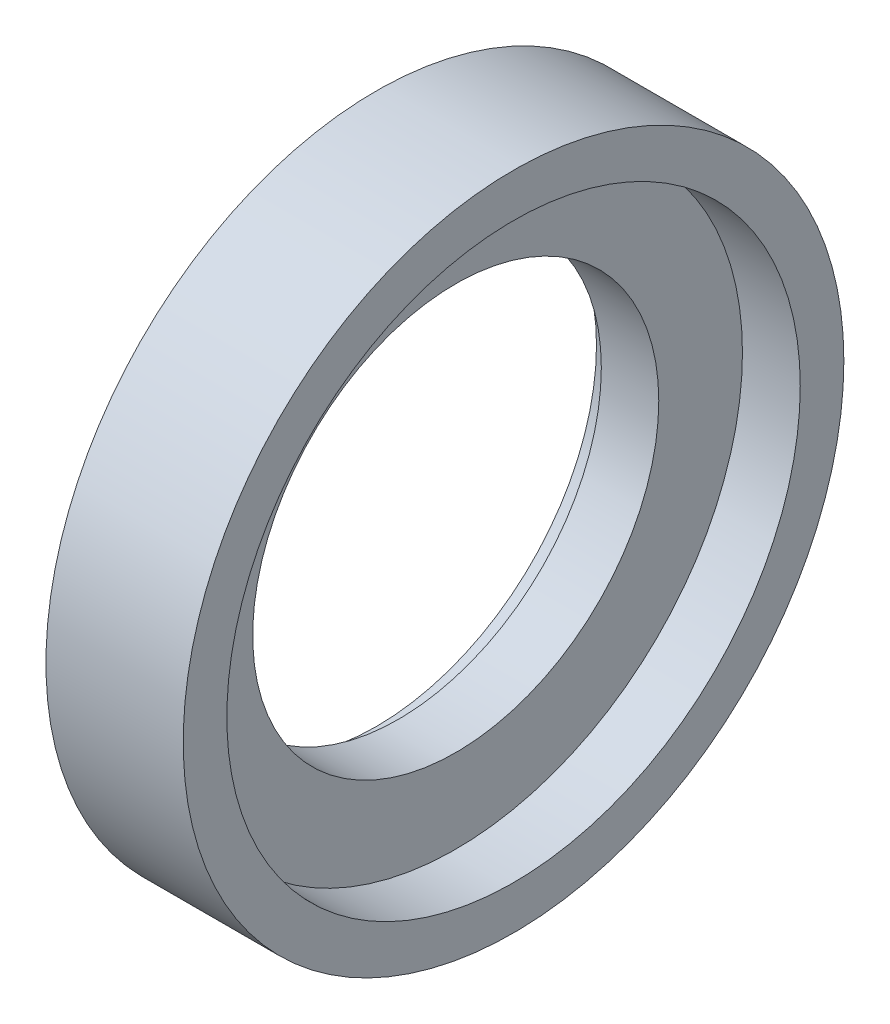
ISO-10303-21;
HEADER;
FILE_DESCRIPTION(('STEP AP214'),'2;1');
FILE_NAME('part.step','',(''),(''),'','','');
FILE_SCHEMA(('AUTOMOTIVE_DESIGN { 1 0 10303 214 1 1 1 1 }'));
ENDSEC;
DATA;
#1=APPLICATION_CONTEXT('core data for automotive mechanical design processes');
#2=APPLICATION_PROTOCOL_DEFINITION('international standard','automotive_design',2000,#1);
#3=PRODUCT_CONTEXT('',#1,'mechanical');
#4=PRODUCT('Part','Part','',(#3));
#5=PRODUCT_RELATED_PRODUCT_CATEGORY('part','',(#4));
#6=PRODUCT_DEFINITION_FORMATION('','',#4);
#7=PRODUCT_DEFINITION_CONTEXT('part definition',#1,'design');
#8=PRODUCT_DEFINITION('design','',#6,#7);
#9=PRODUCT_DEFINITION_SHAPE('','',#8);
#10=(LENGTH_UNIT() NAMED_UNIT(*) SI_UNIT(.MILLI.,.METRE.));
#11=(NAMED_UNIT(*) PLANE_ANGLE_UNIT() SI_UNIT($,.RADIAN.));
#12=(NAMED_UNIT(*) SI_UNIT($,.STERADIAN.) SOLID_ANGLE_UNIT());
#13=UNCERTAINTY_MEASURE_WITH_UNIT(LENGTH_MEASURE(1.E-05),#10,'distance_accuracy_value','');
#14=(GEOMETRIC_REPRESENTATION_CONTEXT(3) GLOBAL_UNCERTAINTY_ASSIGNED_CONTEXT((#13)) GLOBAL_UNIT_ASSIGNED_CONTEXT((#10,
#11,#12)) REPRESENTATION_CONTEXT('',''));
#15=CARTESIAN_POINT('',(0.,0.,0.));
#16=DIRECTION('',(0.,0.,1.));
#17=DIRECTION('',(1.,0.,0.));
#18=AXIS2_PLACEMENT_3D('',#15,#16,#17);
#19=CARTESIAN_POINT('',(1.27,0.,0.));
#20=DIRECTION('',(1.,0.,0.));
#21=DIRECTION('',(0.,0.,-1.));
#22=AXIS2_PLACEMENT_3D('',#19,#20,#21);
#23=CYLINDRICAL_SURFACE('',#22,11.7094);
#24=CARTESIAN_POINT('',(4.583101058,0.,0.));
#25=DIRECTION('',(1.,0.,0.));
#26=DIRECTION('',(0.,0.,-1.));
#27=AXIS2_PLACEMENT_3D('',#24,#25,#26);
#28=CIRCLE('',#27,11.7094);
#29=CARTESIAN_POINT('',(4.583101058,0.,-11.7094));
#30=VERTEX_POINT('',#29);
#31=EDGE_CURVE('E18',#30,#30,#28,.F.);
#32=ORIENTED_EDGE('',*,*,#31,.F.);
#33=EDGE_LOOP('',(#32));
#34=FACE_BOUND('',#33,.T.);
#35=CARTESIAN_POINT('',(1.27,0.,0.));
#36=DIRECTION('',(1.,0.,0.));
#37=DIRECTION('',(0.,0.,-1.));
#38=AXIS2_PLACEMENT_3D('',#35,#36,#37);
#39=CIRCLE('',#38,11.7094);
#40=CARTESIAN_POINT('',(1.27,0.,-11.7094));
#41=VERTEX_POINT('',#40);
#42=EDGE_CURVE('E48',#41,#41,#39,.T.);
#43=ORIENTED_EDGE('',*,*,#42,.F.);
#44=EDGE_LOOP('',(#43));
#45=FACE_BOUND('',#44,.T.);
#46=ADVANCED_FACE('F14',(#34,#45),#23,.F.);
#47=CARTESIAN_POINT('',(4.583101058,-16.7338248,16.7338248));
#48=DIRECTION('',(1.,0.,0.));
#49=DIRECTION('',(0.,0.,-1.));
#50=AXIS2_PLACEMENT_3D('',#47,#48,#49);
#51=PLANE('',#50);
#52=ORIENTED_EDGE('',*,*,#31,.T.);
#53=EDGE_LOOP('',(#52));
#54=FACE_BOUND('',#53,.T.);
#55=CARTESIAN_POINT('',(4.583101058,0.,0.));
#56=DIRECTION('',(1.,0.,0.));
#57=DIRECTION('',(0.,0.,-1.));
#58=AXIS2_PLACEMENT_3D('',#55,#56,#57);
#59=CIRCLE('',#58,16.5354);
#60=CARTESIAN_POINT('',(4.583101058,0.,-16.5354));
#61=VERTEX_POINT('',#60);
#62=EDGE_CURVE('E45',#61,#61,#59,.F.);
#63=ORIENTED_EDGE('',*,*,#62,.F.);
#64=EDGE_LOOP('',(#63));
#65=FACE_BOUND('',#64,.T.);
#66=ADVANCED_FACE('F56',(#54,#65),#51,.T.);
#67=CARTESIAN_POINT('',(1.27,-12.8524,-12.8524));
#68=DIRECTION('',(-1.,0.,0.));
#69=DIRECTION('',(0.,0.,1.));
#70=AXIS2_PLACEMENT_3D('',#67,#68,#69);
#71=PLANE('',#70);
#72=ORIENTED_EDGE('',*,*,#42,.T.);
#73=EDGE_LOOP('',(#72));
#74=FACE_BOUND('',#73,.T.);
#75=CARTESIAN_POINT('',(1.27,0.,0.));
#76=DIRECTION('',(1.,0.,0.));
#77=DIRECTION('',(0.,0.,-1.));
#78=AXIS2_PLACEMENT_3D('',#75,#76,#77);
#79=CIRCLE('',#78,12.7);
#80=CARTESIAN_POINT('',(1.27,0.,-12.7));
#81=VERTEX_POINT('',#80);
#82=EDGE_CURVE('E41',#81,#81,#79,.T.);
#83=ORIENTED_EDGE('',*,*,#82,.F.);
#84=EDGE_LOOP('',(#83));
#85=FACE_BOUND('',#84,.T.);
#86=ADVANCED_FACE('F66',(#74,#85),#71,.T.);
#87=CARTESIAN_POINT('',(4.583101058,0.,0.));
#88=DIRECTION('',(1.,0.,0.));
#89=DIRECTION('',(0.,0.,-1.));
#90=AXIS2_PLACEMENT_3D('',#87,#88,#89);
#91=CYLINDRICAL_SURFACE('',#90,16.5354);
#92=ORIENTED_EDGE('',*,*,#62,.T.);
#93=EDGE_LOOP('',(#92));
#94=FACE_BOUND('',#93,.T.);
#95=CARTESIAN_POINT('',(7.916851058,0.,0.));
#96=DIRECTION('',(1.,0.,0.));
#97=DIRECTION('',(0.,0.,-1.));
#98=AXIS2_PLACEMENT_3D('',#95,#96,#97);
#99=CIRCLE('',#98,16.5354);
#100=CARTESIAN_POINT('',(7.916851058,0.,-16.5354));
#101=VERTEX_POINT('',#100);
#102=EDGE_CURVE('E37',#101,#101,#99,.F.);
#103=ORIENTED_EDGE('',*,*,#102,.F.);
#104=EDGE_LOOP('',(#103));
#105=FACE_BOUND('',#104,.T.);
#106=ADVANCED_FACE('F83',(#94,#105),#91,.F.);
#107=CARTESIAN_POINT('',(0.,0.,0.));
#108=DIRECTION('',(1.,0.,0.));
#109=DIRECTION('',(0.,0.,-1.));
#110=AXIS2_PLACEMENT_3D('',#107,#108,#109);
#111=CYLINDRICAL_SURFACE('',#110,12.7);
#112=ORIENTED_EDGE('',*,*,#82,.T.);
#113=EDGE_LOOP('',(#112));
#114=FACE_BOUND('',#113,.T.);
#115=CARTESIAN_POINT('',(0.,0.,0.));
#116=DIRECTION('',(1.,0.,0.));
#117=DIRECTION('',(0.,0.,-1.));
#118=AXIS2_PLACEMENT_3D('',#115,#116,#117);
#119=CIRCLE('',#118,12.7);
#120=CARTESIAN_POINT('',(0.,0.,-12.7));
#121=VERTEX_POINT('',#120);
#122=EDGE_CURVE('E31',#121,#121,#119,.T.);
#123=ORIENTED_EDGE('',*,*,#122,.F.);
#124=EDGE_LOOP('',(#123));
#125=FACE_BOUND('',#124,.T.);
#126=ADVANCED_FACE('F81',(#114,#125),#111,.F.);
#127=CARTESIAN_POINT('',(7.916851058,-19.2786,19.2786));
#128=DIRECTION('',(1.,0.,0.));
#129=DIRECTION('',(0.,0.,-1.));
#130=AXIS2_PLACEMENT_3D('',#127,#128,#129);
#131=PLANE('',#130);
#132=ORIENTED_EDGE('',*,*,#102,.T.);
#133=EDGE_LOOP('',(#132));
#134=FACE_BOUND('',#133,.T.);
#135=CARTESIAN_POINT('',(7.916851058,0.,0.));
#136=DIRECTION('',(1.,0.,0.));
#137=DIRECTION('',(0.,0.,-1.));
#138=AXIS2_PLACEMENT_3D('',#135,#136,#137);
#139=CIRCLE('',#138,19.05);
#140=CARTESIAN_POINT('',(7.916851058,0.,-19.05));
#141=VERTEX_POINT('',#140);
#142=EDGE_CURVE('E23',#141,#141,#139,.T.);
#143=ORIENTED_EDGE('',*,*,#142,.T.);
#144=EDGE_LOOP('',(#143));
#145=FACE_BOUND('',#144,.T.);
#146=ADVANCED_FACE('F76',(#134,#145),#131,.T.);
#147=CARTESIAN_POINT('',(0.,-19.2786,-19.2786));
#148=DIRECTION('',(-1.,0.,0.));
#149=DIRECTION('',(0.,0.,1.));
#150=AXIS2_PLACEMENT_3D('',#147,#148,#149);
#151=PLANE('',#150);
#152=ORIENTED_EDGE('',*,*,#122,.T.);
#153=EDGE_LOOP('',(#152));
#154=FACE_BOUND('',#153,.T.);
#155=CARTESIAN_POINT('',(0.,0.,0.));
#156=DIRECTION('',(1.,0.,0.));
#157=DIRECTION('',(0.,0.,-1.));
#158=AXIS2_PLACEMENT_3D('',#155,#156,#157);
#159=CIRCLE('',#158,19.05);
#160=CARTESIAN_POINT('',(0.,0.,-19.05));
#161=VERTEX_POINT('',#160);
#162=EDGE_CURVE('E10',#161,#161,#159,.F.);
#163=ORIENTED_EDGE('',*,*,#162,.T.);
#164=EDGE_LOOP('',(#163));
#165=FACE_BOUND('',#164,.T.);
#166=ADVANCED_FACE('F16',(#154,#165),#151,.T.);
#167=CARTESIAN_POINT('',(0.,0.,0.));
#168=DIRECTION('',(1.,0.,0.));
#169=DIRECTION('',(0.,0.,-1.));
#170=AXIS2_PLACEMENT_3D('',#167,#168,#169);
#171=CYLINDRICAL_SURFACE('',#170,19.05);
#172=ORIENTED_EDGE('',*,*,#142,.F.);
#173=EDGE_LOOP('',(#172));
#174=FACE_BOUND('',#173,.T.);
#175=ORIENTED_EDGE('',*,*,#162,.F.);
#176=EDGE_LOOP('',(#175));
#177=FACE_BOUND('',#176,.T.);
#178=ADVANCED_FACE('F69',(#174,#177),#171,.T.);
#179=CLOSED_SHELL('',(#46,#66,#86,#106,#126,#146,#166,#178));
#180=MANIFOLD_SOLID_BREP('B1',#179);
#181=ADVANCED_BREP_SHAPE_REPRESENTATION('',(#18,#180),#14);
#182=SHAPE_DEFINITION_REPRESENTATION(#9,#181);
ENDSEC;
END-ISO-10303-21;
